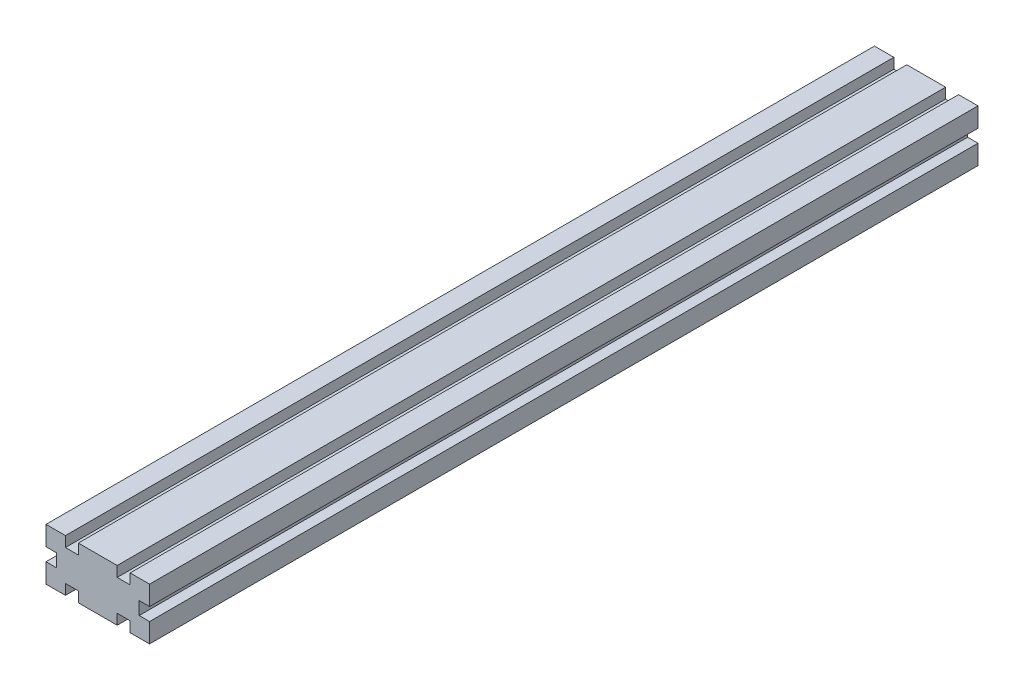
ISO-10303-21;
HEADER;
FILE_DESCRIPTION(('STEP AP214'),'2;1');
FILE_NAME('part.step','',(''),(''),'','','');
FILE_SCHEMA(('AUTOMOTIVE_DESIGN { 1 0 10303 214 1 1 1 1 }'));
ENDSEC;
DATA;
#1=APPLICATION_CONTEXT('core data for automotive mechanical design processes');
#2=APPLICATION_PROTOCOL_DEFINITION('international standard','automotive_design',2000,#1);
#3=PRODUCT_CONTEXT('',#1,'mechanical');
#4=PRODUCT('Part','Part','',(#3));
#5=PRODUCT_RELATED_PRODUCT_CATEGORY('part','',(#4));
#6=PRODUCT_DEFINITION_FORMATION('','',#4);
#7=PRODUCT_DEFINITION_CONTEXT('part definition',#1,'design');
#8=PRODUCT_DEFINITION('design','',#6,#7);
#9=PRODUCT_DEFINITION_SHAPE('','',#8);
#10=(LENGTH_UNIT() NAMED_UNIT(*) SI_UNIT(.MILLI.,.METRE.));
#11=(NAMED_UNIT(*) PLANE_ANGLE_UNIT() SI_UNIT($,.RADIAN.));
#12=(NAMED_UNIT(*) SI_UNIT($,.STERADIAN.) SOLID_ANGLE_UNIT());
#13=UNCERTAINTY_MEASURE_WITH_UNIT(LENGTH_MEASURE(1.E-05),#10,'distance_accuracy_value','');
#14=(GEOMETRIC_REPRESENTATION_CONTEXT(3) GLOBAL_UNCERTAINTY_ASSIGNED_CONTEXT((#13)) GLOBAL_UNIT_ASSIGNED_CONTEXT((#10,
#11,#12)) REPRESENTATION_CONTEXT('',''));
#15=CARTESIAN_POINT('',(0.,0.,0.));
#16=DIRECTION('',(0.,0.,1.));
#17=DIRECTION('',(1.,0.,0.));
#18=AXIS2_PLACEMENT_3D('',#15,#16,#17);
#19=CARTESIAN_POINT('',(40.,0.,320.));
#20=DIRECTION('',(-1.,0.,0.));
#21=DIRECTION('',(0.,0.,1.));
#22=AXIS2_PLACEMENT_3D('',#19,#20,#21);
#23=PLANE('',#22);
#24=DIRECTION('',(0.,1.,0.));
#25=VECTOR('',#24,1.);
#26=CARTESIAN_POINT('',(40.,0.,0.));
#27=LINE('',#26,#25);
#28=CARTESIAN_POINT('',(40.,12.5,0.));
#29=VERTEX_POINT('',#28);
#30=CARTESIAN_POINT('',(40.,20.,0.));
#31=VERTEX_POINT('',#30);
#32=EDGE_CURVE('E257',#29,#31,#27,.T.);
#33=ORIENTED_EDGE('',*,*,#32,.T.);
#34=DIRECTION('',(0.,0.,-1.));
#35=VECTOR('',#34,1.);
#36=CARTESIAN_POINT('',(40.,20.,320.));
#37=LINE('',#36,#35);
#38=CARTESIAN_POINT('',(40.,20.,320.));
#39=VERTEX_POINT('',#38);
#40=EDGE_CURVE('E11',#39,#31,#37,.T.);
#41=ORIENTED_EDGE('',*,*,#40,.F.);
#42=DIRECTION('',(0.,1.,0.));
#43=VECTOR('',#42,1.);
#44=CARTESIAN_POINT('',(40.,0.,320.));
#45=LINE('',#44,#43);
#46=CARTESIAN_POINT('',(40.,12.5,320.));
#47=VERTEX_POINT('',#46);
#48=EDGE_CURVE('E156',#47,#39,#45,.T.);
#49=ORIENTED_EDGE('',*,*,#48,.F.);
#50=DIRECTION('',(0.,0.,-1.));
#51=VECTOR('',#50,1.);
#52=CARTESIAN_POINT('',(40.,12.5,320.));
#53=LINE('',#52,#51);
#54=EDGE_CURVE('E256',#47,#29,#53,.T.);
#55=ORIENTED_EDGE('',*,*,#54,.T.);
#56=EDGE_LOOP('',(#33,#41,#49,#55));
#57=FACE_BOUND('',#56,.T.);
#58=ADVANCED_FACE('F41',(#57),#23,.F.);
#59=CARTESIAN_POINT('',(0.,20.,320.));
#60=DIRECTION('',(0.,1.,0.));
#61=DIRECTION('',(0.,0.,1.));
#62=AXIS2_PLACEMENT_3D('',#59,#60,#61);
#63=PLANE('',#62);
#64=DIRECTION('',(1.,0.,0.));
#65=VECTOR('',#64,1.);
#66=CARTESIAN_POINT('',(0.,20.,0.));
#67=LINE('',#66,#65);
#68=CARTESIAN_POINT('',(32.5,20.,0.));
#69=VERTEX_POINT('',#68);
#70=EDGE_CURVE('E260',#69,#31,#67,.T.);
#71=ORIENTED_EDGE('',*,*,#70,.F.);
#72=DIRECTION('',(0.,0.,-1.));
#73=VECTOR('',#72,1.);
#74=CARTESIAN_POINT('',(32.5,20.,320.));
#75=LINE('',#74,#73);
#76=CARTESIAN_POINT('',(32.5,20.,320.));
#77=VERTEX_POINT('',#76);
#78=EDGE_CURVE('E49',#77,#69,#75,.T.);
#79=ORIENTED_EDGE('',*,*,#78,.F.);
#80=DIRECTION('',(1.,0.,0.));
#81=VECTOR('',#80,1.);
#82=CARTESIAN_POINT('',(0.,20.,320.));
#83=LINE('',#82,#81);
#84=EDGE_CURVE('E402',#77,#39,#83,.T.);
#85=ORIENTED_EDGE('',*,*,#84,.T.);
#86=ORIENTED_EDGE('',*,*,#40,.T.);
#87=EDGE_LOOP('',(#71,#79,#85,#86));
#88=FACE_BOUND('',#87,.T.);
#89=ADVANCED_FACE('F390',(#88),#63,.T.);
#90=CARTESIAN_POINT('',(32.5,0.,320.));
#91=DIRECTION('',(-1.,0.,0.));
#92=DIRECTION('',(0.,0.,1.));
#93=AXIS2_PLACEMENT_3D('',#90,#91,#92);
#94=PLANE('',#93);
#95=DIRECTION('',(0.,1.,0.));
#96=VECTOR('',#95,1.);
#97=CARTESIAN_POINT('',(32.5,0.,0.));
#98=LINE('',#97,#96);
#99=CARTESIAN_POINT('',(32.5,16.,0.));
#100=VERTEX_POINT('',#99);
#101=EDGE_CURVE('E263',#100,#69,#98,.T.);
#102=ORIENTED_EDGE('',*,*,#101,.F.);
#103=DIRECTION('',(0.,0.,-1.));
#104=VECTOR('',#103,1.);
#105=CARTESIAN_POINT('',(32.5,16.,320.));
#106=LINE('',#105,#104);
#107=CARTESIAN_POINT('',(32.5,16.,320.));
#108=VERTEX_POINT('',#107);
#109=EDGE_CURVE('E380',#108,#100,#106,.T.);
#110=ORIENTED_EDGE('',*,*,#109,.F.);
#111=DIRECTION('',(0.,1.,0.));
#112=VECTOR('',#111,1.);
#113=CARTESIAN_POINT('',(32.5,0.,320.));
#114=LINE('',#113,#112);
#115=EDGE_CURVE('E387',#108,#77,#114,.T.);
#116=ORIENTED_EDGE('',*,*,#115,.T.);
#117=ORIENTED_EDGE('',*,*,#78,.T.);
#118=EDGE_LOOP('',(#102,#110,#116,#117));
#119=FACE_BOUND('',#118,.T.);
#120=ADVANCED_FACE('F385',(#119),#94,.T.);
#121=CARTESIAN_POINT('',(0.,16.,320.));
#122=DIRECTION('',(0.,1.,0.));
#123=DIRECTION('',(0.,0.,1.));
#124=AXIS2_PLACEMENT_3D('',#121,#122,#123);
#125=PLANE('',#124);
#126=DIRECTION('',(1.,0.,0.));
#127=VECTOR('',#126,1.);
#128=CARTESIAN_POINT('',(0.,16.,0.));
#129=LINE('',#128,#127);
#130=CARTESIAN_POINT('',(27.5,16.,0.));
#131=VERTEX_POINT('',#130);
#132=EDGE_CURVE('E266',#131,#100,#129,.T.);
#133=ORIENTED_EDGE('',*,*,#132,.F.);
#134=DIRECTION('',(0.,0.,-1.));
#135=VECTOR('',#134,1.);
#136=CARTESIAN_POINT('',(27.5,16.,320.));
#137=LINE('',#136,#135);
#138=CARTESIAN_POINT('',(27.5,16.,320.));
#139=VERTEX_POINT('',#138);
#140=EDGE_CURVE('E378',#139,#131,#137,.T.);
#141=ORIENTED_EDGE('',*,*,#140,.F.);
#142=DIRECTION('',(1.,0.,0.));
#143=VECTOR('',#142,1.);
#144=CARTESIAN_POINT('',(0.,16.,320.));
#145=LINE('',#144,#143);
#146=EDGE_CURVE('E401',#139,#108,#145,.T.);
#147=ORIENTED_EDGE('',*,*,#146,.T.);
#148=ORIENTED_EDGE('',*,*,#109,.T.);
#149=EDGE_LOOP('',(#133,#141,#147,#148));
#150=FACE_BOUND('',#149,.T.);
#151=ADVANCED_FACE('F397',(#150),#125,.T.);
#152=CARTESIAN_POINT('',(27.5,0.,320.));
#153=DIRECTION('',(-1.,0.,0.));
#154=DIRECTION('',(0.,0.,1.));
#155=AXIS2_PLACEMENT_3D('',#152,#153,#154);
#156=PLANE('',#155);
#157=DIRECTION('',(0.,1.,0.));
#158=VECTOR('',#157,1.);
#159=CARTESIAN_POINT('',(27.5,0.,0.));
#160=LINE('',#159,#158);
#161=CARTESIAN_POINT('',(27.5,20.,0.));
#162=VERTEX_POINT('',#161);
#163=EDGE_CURVE('E269',#131,#162,#160,.T.);
#164=ORIENTED_EDGE('',*,*,#163,.T.);
#165=DIRECTION('',(0.,0.,-1.));
#166=VECTOR('',#165,1.);
#167=CARTESIAN_POINT('',(27.5,20.,320.));
#168=LINE('',#167,#166);
#169=CARTESIAN_POINT('',(27.5,20.,320.));
#170=VERTEX_POINT('',#169);
#171=EDGE_CURVE('E376',#170,#162,#168,.T.);
#172=ORIENTED_EDGE('',*,*,#171,.F.);
#173=DIRECTION('',(0.,1.,0.));
#174=VECTOR('',#173,1.);
#175=CARTESIAN_POINT('',(27.5,0.,320.));
#176=LINE('',#175,#174);
#177=EDGE_CURVE('E404',#139,#170,#176,.T.);
#178=ORIENTED_EDGE('',*,*,#177,.F.);
#179=ORIENTED_EDGE('',*,*,#140,.T.);
#180=EDGE_LOOP('',(#164,#172,#178,#179));
#181=FACE_BOUND('',#180,.T.);
#182=ADVANCED_FACE('F486',(#181),#156,.F.);
#183=CARTESIAN_POINT('',(0.,20.,320.));
#184=DIRECTION('',(0.,1.,0.));
#185=DIRECTION('',(0.,0.,1.));
#186=AXIS2_PLACEMENT_3D('',#183,#184,#185);
#187=PLANE('',#186);
#188=DIRECTION('',(1.,0.,0.));
#189=VECTOR('',#188,1.);
#190=CARTESIAN_POINT('',(0.,20.,0.));
#191=LINE('',#190,#189);
#192=CARTESIAN_POINT('',(12.5,20.,0.));
#193=VERTEX_POINT('',#192);
#194=EDGE_CURVE('E272',#193,#162,#191,.T.);
#195=ORIENTED_EDGE('',*,*,#194,.F.);
#196=DIRECTION('',(0.,0.,-1.));
#197=VECTOR('',#196,1.);
#198=CARTESIAN_POINT('',(12.5,20.,320.));
#199=LINE('',#198,#197);
#200=CARTESIAN_POINT('',(12.5,20.,320.));
#201=VERTEX_POINT('',#200);
#202=EDGE_CURVE('E374',#201,#193,#199,.T.);
#203=ORIENTED_EDGE('',*,*,#202,.F.);
#204=DIRECTION('',(1.,0.,0.));
#205=VECTOR('',#204,1.);
#206=CARTESIAN_POINT('',(0.,20.,320.));
#207=LINE('',#206,#205);
#208=EDGE_CURVE('E410',#201,#170,#207,.T.);
#209=ORIENTED_EDGE('',*,*,#208,.T.);
#210=ORIENTED_EDGE('',*,*,#171,.T.);
#211=EDGE_LOOP('',(#195,#203,#209,#210));
#212=FACE_BOUND('',#211,.T.);
#213=ADVANCED_FACE('F489',(#212),#187,.T.);
#214=CARTESIAN_POINT('',(12.5,0.,320.));
#215=DIRECTION('',(-1.,0.,0.));
#216=DIRECTION('',(0.,0.,1.));
#217=AXIS2_PLACEMENT_3D('',#214,#215,#216);
#218=PLANE('',#217);
#219=DIRECTION('',(0.,1.,0.));
#220=VECTOR('',#219,1.);
#221=CARTESIAN_POINT('',(12.5,0.,0.));
#222=LINE('',#221,#220);
#223=CARTESIAN_POINT('',(12.5,16.,0.));
#224=VERTEX_POINT('',#223);
#225=EDGE_CURVE('E275',#224,#193,#222,.T.);
#226=ORIENTED_EDGE('',*,*,#225,.F.);
#227=DIRECTION('',(0.,0.,-1.));
#228=VECTOR('',#227,1.);
#229=CARTESIAN_POINT('',(12.5,16.,320.));
#230=LINE('',#229,#228);
#231=CARTESIAN_POINT('',(12.5,16.,320.));
#232=VERTEX_POINT('',#231);
#233=EDGE_CURVE('E372',#232,#224,#230,.T.);
#234=ORIENTED_EDGE('',*,*,#233,.F.);
#235=DIRECTION('',(0.,1.,0.));
#236=VECTOR('',#235,1.);
#237=CARTESIAN_POINT('',(12.5,0.,320.));
#238=LINE('',#237,#236);
#239=EDGE_CURVE('E413',#232,#201,#238,.T.);
#240=ORIENTED_EDGE('',*,*,#239,.T.);
#241=ORIENTED_EDGE('',*,*,#202,.T.);
#242=EDGE_LOOP('',(#226,#234,#240,#241));
#243=FACE_BOUND('',#242,.T.);
#244=ADVANCED_FACE('F493',(#243),#218,.T.);
#245=CARTESIAN_POINT('',(0.,16.,320.));
#246=DIRECTION('',(0.,1.,0.));
#247=DIRECTION('',(0.,0.,1.));
#248=AXIS2_PLACEMENT_3D('',#245,#246,#247);
#249=PLANE('',#248);
#250=DIRECTION('',(1.,0.,0.));
#251=VECTOR('',#250,1.);
#252=CARTESIAN_POINT('',(0.,16.,0.));
#253=LINE('',#252,#251);
#254=CARTESIAN_POINT('',(7.5,16.,0.));
#255=VERTEX_POINT('',#254);
#256=EDGE_CURVE('E278',#255,#224,#253,.T.);
#257=ORIENTED_EDGE('',*,*,#256,.F.);
#258=DIRECTION('',(0.,0.,-1.));
#259=VECTOR('',#258,1.);
#260=CARTESIAN_POINT('',(7.5,16.,320.));
#261=LINE('',#260,#259);
#262=CARTESIAN_POINT('',(7.5,16.,320.));
#263=VERTEX_POINT('',#262);
#264=EDGE_CURVE('E370',#263,#255,#261,.T.);
#265=ORIENTED_EDGE('',*,*,#264,.F.);
#266=DIRECTION('',(1.,0.,0.));
#267=VECTOR('',#266,1.);
#268=CARTESIAN_POINT('',(0.,16.,320.));
#269=LINE('',#268,#267);
#270=EDGE_CURVE('E416',#263,#232,#269,.T.);
#271=ORIENTED_EDGE('',*,*,#270,.T.);
#272=ORIENTED_EDGE('',*,*,#233,.T.);
#273=EDGE_LOOP('',(#257,#265,#271,#272));
#274=FACE_BOUND('',#273,.T.);
#275=ADVANCED_FACE('F497',(#274),#249,.T.);
#276=CARTESIAN_POINT('',(7.5,0.,320.));
#277=DIRECTION('',(-1.,0.,0.));
#278=DIRECTION('',(0.,0.,1.));
#279=AXIS2_PLACEMENT_3D('',#276,#277,#278);
#280=PLANE('',#279);
#281=DIRECTION('',(0.,1.,0.));
#282=VECTOR('',#281,1.);
#283=CARTESIAN_POINT('',(7.5,0.,0.));
#284=LINE('',#283,#282);
#285=CARTESIAN_POINT('',(7.5,20.,0.));
#286=VERTEX_POINT('',#285);
#287=EDGE_CURVE('E281',#255,#286,#284,.T.);
#288=ORIENTED_EDGE('',*,*,#287,.T.);
#289=DIRECTION('',(0.,0.,-1.));
#290=VECTOR('',#289,1.);
#291=CARTESIAN_POINT('',(7.5,20.,320.));
#292=LINE('',#291,#290);
#293=CARTESIAN_POINT('',(7.5,20.,320.));
#294=VERTEX_POINT('',#293);
#295=EDGE_CURVE('E368',#294,#286,#292,.T.);
#296=ORIENTED_EDGE('',*,*,#295,.F.);
#297=DIRECTION('',(0.,1.,0.));
#298=VECTOR('',#297,1.);
#299=CARTESIAN_POINT('',(7.5,0.,320.));
#300=LINE('',#299,#298);
#301=EDGE_CURVE('E419',#263,#294,#300,.T.);
#302=ORIENTED_EDGE('',*,*,#301,.F.);
#303=ORIENTED_EDGE('',*,*,#264,.T.);
#304=EDGE_LOOP('',(#288,#296,#302,#303));
#305=FACE_BOUND('',#304,.T.);
#306=ADVANCED_FACE('F501',(#305),#280,.F.);
#307=CARTESIAN_POINT('',(0.,20.,320.));
#308=DIRECTION('',(0.,1.,0.));
#309=DIRECTION('',(0.,0.,1.));
#310=AXIS2_PLACEMENT_3D('',#307,#308,#309);
#311=PLANE('',#310);
#312=DIRECTION('',(1.,0.,0.));
#313=VECTOR('',#312,1.);
#314=CARTESIAN_POINT('',(0.,20.,0.));
#315=LINE('',#314,#313);
#316=CARTESIAN_POINT('',(0.,20.,0.));
#317=VERTEX_POINT('',#316);
#318=EDGE_CURVE('E284',#317,#286,#315,.T.);
#319=ORIENTED_EDGE('',*,*,#318,.F.);
#320=DIRECTION('',(0.,0.,-1.));
#321=VECTOR('',#320,1.);
#322=CARTESIAN_POINT('',(0.,20.,320.));
#323=LINE('',#322,#321);
#324=CARTESIAN_POINT('',(0.,20.,320.));
#325=VERTEX_POINT('',#324);
#326=EDGE_CURVE('E366',#325,#317,#323,.T.);
#327=ORIENTED_EDGE('',*,*,#326,.F.);
#328=DIRECTION('',(1.,0.,0.));
#329=VECTOR('',#328,1.);
#330=CARTESIAN_POINT('',(0.,20.,320.));
#331=LINE('',#330,#329);
#332=EDGE_CURVE('E421',#325,#294,#331,.T.);
#333=ORIENTED_EDGE('',*,*,#332,.T.);
#334=ORIENTED_EDGE('',*,*,#295,.T.);
#335=EDGE_LOOP('',(#319,#327,#333,#334));
#336=FACE_BOUND('',#335,.T.);
#337=ADVANCED_FACE('F505',(#336),#311,.T.);
#338=CARTESIAN_POINT('',(0.,0.,320.));
#339=DIRECTION('',(-1.,0.,0.));
#340=DIRECTION('',(0.,0.,1.));
#341=AXIS2_PLACEMENT_3D('',#338,#339,#340);
#342=PLANE('',#341);
#343=DIRECTION('',(0.,1.,0.));
#344=VECTOR('',#343,1.);
#345=CARTESIAN_POINT('',(0.,0.,0.));
#346=LINE('',#345,#344);
#347=CARTESIAN_POINT('',(0.,12.5,0.));
#348=VERTEX_POINT('',#347);
#349=EDGE_CURVE('E287',#348,#317,#346,.T.);
#350=ORIENTED_EDGE('',*,*,#349,.F.);
#351=DIRECTION('',(0.,0.,-1.));
#352=VECTOR('',#351,1.);
#353=CARTESIAN_POINT('',(0.,12.5,320.));
#354=LINE('',#353,#352);
#355=CARTESIAN_POINT('',(0.,12.5,320.));
#356=VERTEX_POINT('',#355);
#357=EDGE_CURVE('E364',#356,#348,#354,.T.);
#358=ORIENTED_EDGE('',*,*,#357,.F.);
#359=DIRECTION('',(0.,1.,0.));
#360=VECTOR('',#359,1.);
#361=CARTESIAN_POINT('',(0.,0.,320.));
#362=LINE('',#361,#360);
#363=EDGE_CURVE('E424',#356,#325,#362,.T.);
#364=ORIENTED_EDGE('',*,*,#363,.T.);
#365=ORIENTED_EDGE('',*,*,#326,.T.);
#366=EDGE_LOOP('',(#350,#358,#364,#365));
#367=FACE_BOUND('',#366,.T.);
#368=ADVANCED_FACE('F509',(#367),#342,.T.);
#369=CARTESIAN_POINT('',(0.,12.5,320.));
#370=DIRECTION('',(0.,1.,0.));
#371=DIRECTION('',(-1.,0.,0.));
#372=AXIS2_PLACEMENT_3D('',#369,#370,#371);
#373=PLANE('',#372);
#374=DIRECTION('',(1.,0.,0.));
#375=VECTOR('',#374,1.);
#376=CARTESIAN_POINT('',(0.,12.5,0.));
#377=LINE('',#376,#375);
#378=CARTESIAN_POINT('',(4.,12.5,0.));
#379=VERTEX_POINT('',#378);
#380=EDGE_CURVE('E290',#348,#379,#377,.T.);
#381=ORIENTED_EDGE('',*,*,#380,.T.);
#382=DIRECTION('',(0.,0.,-1.));
#383=VECTOR('',#382,1.);
#384=CARTESIAN_POINT('',(4.,12.5,320.));
#385=LINE('',#384,#383);
#386=CARTESIAN_POINT('',(4.,12.5,320.));
#387=VERTEX_POINT('',#386);
#388=EDGE_CURVE('E362',#387,#379,#385,.T.);
#389=ORIENTED_EDGE('',*,*,#388,.F.);
#390=DIRECTION('',(1.,0.,0.));
#391=VECTOR('',#390,1.);
#392=CARTESIAN_POINT('',(0.,12.5,320.));
#393=LINE('',#392,#391);
#394=EDGE_CURVE('E427',#356,#387,#393,.T.);
#395=ORIENTED_EDGE('',*,*,#394,.F.);
#396=ORIENTED_EDGE('',*,*,#357,.T.);
#397=EDGE_LOOP('',(#381,#389,#395,#396));
#398=FACE_BOUND('',#397,.T.);
#399=ADVANCED_FACE('F513',(#398),#373,.F.);
#400=CARTESIAN_POINT('',(4.,0.,320.));
#401=DIRECTION('',(-1.,0.,0.));
#402=DIRECTION('',(0.,0.,1.));
#403=AXIS2_PLACEMENT_3D('',#400,#401,#402);
#404=PLANE('',#403);
#405=DIRECTION('',(0.,1.,0.));
#406=VECTOR('',#405,1.);
#407=CARTESIAN_POINT('',(4.,0.,0.));
#408=LINE('',#407,#406);
#409=CARTESIAN_POINT('',(4.,7.5,0.));
#410=VERTEX_POINT('',#409);
#411=EDGE_CURVE('E293',#410,#379,#408,.T.);
#412=ORIENTED_EDGE('',*,*,#411,.F.);
#413=DIRECTION('',(0.,0.,-1.));
#414=VECTOR('',#413,1.);
#415=CARTESIAN_POINT('',(4.,7.5,320.));
#416=LINE('',#415,#414);
#417=CARTESIAN_POINT('',(4.,7.5,320.));
#418=VERTEX_POINT('',#417);
#419=EDGE_CURVE('E360',#418,#410,#416,.T.);
#420=ORIENTED_EDGE('',*,*,#419,.F.);
#421=DIRECTION('',(0.,1.,0.));
#422=VECTOR('',#421,1.);
#423=CARTESIAN_POINT('',(4.,0.,320.));
#424=LINE('',#423,#422);
#425=EDGE_CURVE('E429',#418,#387,#424,.T.);
#426=ORIENTED_EDGE('',*,*,#425,.T.);
#427=ORIENTED_EDGE('',*,*,#388,.T.);
#428=EDGE_LOOP('',(#412,#420,#426,#427));
#429=FACE_BOUND('',#428,.T.);
#430=ADVANCED_FACE('F517',(#429),#404,.T.);
#431=CARTESIAN_POINT('',(0.,7.5,320.));
#432=DIRECTION('',(0.,1.,0.));
#433=DIRECTION('',(-1.,0.,0.));
#434=AXIS2_PLACEMENT_3D('',#431,#432,#433);
#435=PLANE('',#434);
#436=DIRECTION('',(1.,0.,0.));
#437=VECTOR('',#436,1.);
#438=CARTESIAN_POINT('',(0.,7.5,0.));
#439=LINE('',#438,#437);
#440=CARTESIAN_POINT('',(0.,7.5,0.));
#441=VERTEX_POINT('',#440);
#442=EDGE_CURVE('E296',#441,#410,#439,.T.);
#443=ORIENTED_EDGE('',*,*,#442,.F.);
#444=DIRECTION('',(0.,0.,-1.));
#445=VECTOR('',#444,1.);
#446=CARTESIAN_POINT('',(0.,7.5,320.));
#447=LINE('',#446,#445);
#448=CARTESIAN_POINT('',(0.,7.5,320.));
#449=VERTEX_POINT('',#448);
#450=EDGE_CURVE('E358',#449,#441,#447,.T.);
#451=ORIENTED_EDGE('',*,*,#450,.F.);
#452=DIRECTION('',(1.,0.,0.));
#453=VECTOR('',#452,1.);
#454=CARTESIAN_POINT('',(0.,7.5,320.));
#455=LINE('',#454,#453);
#456=EDGE_CURVE('E432',#449,#418,#455,.T.);
#457=ORIENTED_EDGE('',*,*,#456,.T.);
#458=ORIENTED_EDGE('',*,*,#419,.T.);
#459=EDGE_LOOP('',(#443,#451,#457,#458));
#460=FACE_BOUND('',#459,.T.);
#461=ADVANCED_FACE('F521',(#460),#435,.T.);
#462=CARTESIAN_POINT('',(0.,0.,320.));
#463=DIRECTION('',(-1.,0.,0.));
#464=DIRECTION('',(0.,0.,1.));
#465=AXIS2_PLACEMENT_3D('',#462,#463,#464);
#466=PLANE('',#465);
#467=DIRECTION('',(0.,1.,0.));
#468=VECTOR('',#467,1.);
#469=CARTESIAN_POINT('',(0.,0.,0.));
#470=LINE('',#469,#468);
#471=CARTESIAN_POINT('',(0.,0.,0.));
#472=VERTEX_POINT('',#471);
#473=EDGE_CURVE('E299',#472,#441,#470,.T.);
#474=ORIENTED_EDGE('',*,*,#473,.F.);
#475=DIRECTION('',(0.,0.,-1.));
#476=VECTOR('',#475,1.);
#477=CARTESIAN_POINT('',(0.,0.,320.));
#478=LINE('',#477,#476);
#479=CARTESIAN_POINT('',(0.,0.,320.));
#480=VERTEX_POINT('',#479);
#481=EDGE_CURVE('E356',#480,#472,#478,.T.);
#482=ORIENTED_EDGE('',*,*,#481,.F.);
#483=DIRECTION('',(0.,1.,0.));
#484=VECTOR('',#483,1.);
#485=CARTESIAN_POINT('',(0.,0.,320.));
#486=LINE('',#485,#484);
#487=EDGE_CURVE('E435',#480,#449,#486,.T.);
#488=ORIENTED_EDGE('',*,*,#487,.T.);
#489=ORIENTED_EDGE('',*,*,#450,.T.);
#490=EDGE_LOOP('',(#474,#482,#488,#489));
#491=FACE_BOUND('',#490,.T.);
#492=ADVANCED_FACE('F525',(#491),#466,.T.);
#493=CARTESIAN_POINT('',(0.,0.,320.));
#494=DIRECTION('',(0.,1.,0.));
#495=DIRECTION('',(0.,0.,1.));
#496=AXIS2_PLACEMENT_3D('',#493,#494,#495);
#497=PLANE('',#496);
#498=DIRECTION('',(1.,0.,0.));
#499=VECTOR('',#498,1.);
#500=CARTESIAN_POINT('',(0.,0.,0.));
#501=LINE('',#500,#499);
#502=CARTESIAN_POINT('',(7.5,0.,0.));
#503=VERTEX_POINT('',#502);
#504=EDGE_CURVE('E302',#472,#503,#501,.T.);
#505=ORIENTED_EDGE('',*,*,#504,.T.);
#506=DIRECTION('',(0.,0.,-1.));
#507=VECTOR('',#506,1.);
#508=CARTESIAN_POINT('',(7.5,0.,320.));
#509=LINE('',#508,#507);
#510=CARTESIAN_POINT('',(7.5,0.,320.));
#511=VERTEX_POINT('',#510);
#512=EDGE_CURVE('E353',#511,#503,#509,.T.);
#513=ORIENTED_EDGE('',*,*,#512,.F.);
#514=DIRECTION('',(1.,0.,0.));
#515=VECTOR('',#514,1.);
#516=CARTESIAN_POINT('',(0.,0.,320.));
#517=LINE('',#516,#515);
#518=EDGE_CURVE('E438',#480,#511,#517,.T.);
#519=ORIENTED_EDGE('',*,*,#518,.F.);
#520=ORIENTED_EDGE('',*,*,#481,.T.);
#521=EDGE_LOOP('',(#505,#513,#519,#520));
#522=FACE_BOUND('',#521,.T.);
#523=ADVANCED_FACE('F529',(#522),#497,.F.);
#524=CARTESIAN_POINT('',(7.5,0.,320.));
#525=DIRECTION('',(-1.,0.,0.));
#526=DIRECTION('',(0.,0.,1.));
#527=AXIS2_PLACEMENT_3D('',#524,#525,#526);
#528=PLANE('',#527);
#529=DIRECTION('',(0.,1.,0.));
#530=VECTOR('',#529,1.);
#531=CARTESIAN_POINT('',(7.5,0.,0.));
#532=LINE('',#531,#530);
#533=CARTESIAN_POINT('',(7.5,4.,0.));
#534=VERTEX_POINT('',#533);
#535=EDGE_CURVE('E304',#503,#534,#532,.T.);
#536=ORIENTED_EDGE('',*,*,#535,.T.);
#537=DIRECTION('',(0.,0.,-1.));
#538=VECTOR('',#537,1.);
#539=CARTESIAN_POINT('',(7.5,4.,320.));
#540=LINE('',#539,#538);
#541=CARTESIAN_POINT('',(7.5,4.,320.));
#542=VERTEX_POINT('',#541);
#543=EDGE_CURVE('E350',#542,#534,#540,.T.);
#544=ORIENTED_EDGE('',*,*,#543,.F.);
#545=DIRECTION('',(0.,1.,0.));
#546=VECTOR('',#545,1.);
#547=CARTESIAN_POINT('',(7.5,0.,320.));
#548=LINE('',#547,#546);
#549=EDGE_CURVE('E440',#511,#542,#548,.T.);
#550=ORIENTED_EDGE('',*,*,#549,.F.);
#551=ORIENTED_EDGE('',*,*,#512,.T.);
#552=EDGE_LOOP('',(#536,#544,#550,#551));
#553=FACE_BOUND('',#552,.T.);
#554=ADVANCED_FACE('F533',(#553),#528,.F.);
#555=CARTESIAN_POINT('',(0.,4.,320.));
#556=DIRECTION('',(0.,1.,0.));
#557=DIRECTION('',(0.,0.,1.));
#558=AXIS2_PLACEMENT_3D('',#555,#556,#557);
#559=PLANE('',#558);
#560=DIRECTION('',(1.,0.,0.));
#561=VECTOR('',#560,1.);
#562=CARTESIAN_POINT('',(0.,4.,0.));
#563=LINE('',#562,#561);
#564=CARTESIAN_POINT('',(12.5,4.,0.));
#565=VERTEX_POINT('',#564);
#566=EDGE_CURVE('E306',#534,#565,#563,.T.);
#567=ORIENTED_EDGE('',*,*,#566,.T.);
#568=DIRECTION('',(0.,0.,-1.));
#569=VECTOR('',#568,1.);
#570=CARTESIAN_POINT('',(12.5,4.,320.));
#571=LINE('',#570,#569);
#572=CARTESIAN_POINT('',(12.5,4.,320.));
#573=VERTEX_POINT('',#572);
#574=EDGE_CURVE('E348',#573,#565,#571,.T.);
#575=ORIENTED_EDGE('',*,*,#574,.F.);
#576=DIRECTION('',(1.,0.,0.));
#577=VECTOR('',#576,1.);
#578=CARTESIAN_POINT('',(0.,4.,320.));
#579=LINE('',#578,#577);
#580=EDGE_CURVE('E442',#542,#573,#579,.T.);
#581=ORIENTED_EDGE('',*,*,#580,.F.);
#582=ORIENTED_EDGE('',*,*,#543,.T.);
#583=EDGE_LOOP('',(#567,#575,#581,#582));
#584=FACE_BOUND('',#583,.T.);
#585=ADVANCED_FACE('F537',(#584),#559,.F.);
#586=CARTESIAN_POINT('',(12.5,0.,320.));
#587=DIRECTION('',(-1.,0.,0.));
#588=DIRECTION('',(0.,0.,1.));
#589=AXIS2_PLACEMENT_3D('',#586,#587,#588);
#590=PLANE('',#589);
#591=DIRECTION('',(0.,1.,0.));
#592=VECTOR('',#591,1.);
#593=CARTESIAN_POINT('',(12.5,0.,0.));
#594=LINE('',#593,#592);
#595=CARTESIAN_POINT('',(12.5,0.,0.));
#596=VERTEX_POINT('',#595);
#597=EDGE_CURVE('E309',#596,#565,#594,.T.);
#598=ORIENTED_EDGE('',*,*,#597,.F.);
#599=DIRECTION('',(0.,0.,-1.));
#600=VECTOR('',#599,1.);
#601=CARTESIAN_POINT('',(12.5,0.,320.));
#602=LINE('',#601,#600);
#603=CARTESIAN_POINT('',(12.5,0.,320.));
#604=VERTEX_POINT('',#603);
#605=EDGE_CURVE('E346',#604,#596,#602,.T.);
#606=ORIENTED_EDGE('',*,*,#605,.F.);
#607=DIRECTION('',(0.,1.,0.));
#608=VECTOR('',#607,1.);
#609=CARTESIAN_POINT('',(12.5,0.,320.));
#610=LINE('',#609,#608);
#611=EDGE_CURVE('E444',#604,#573,#610,.T.);
#612=ORIENTED_EDGE('',*,*,#611,.T.);
#613=ORIENTED_EDGE('',*,*,#574,.T.);
#614=EDGE_LOOP('',(#598,#606,#612,#613));
#615=FACE_BOUND('',#614,.T.);
#616=ADVANCED_FACE('F541',(#615),#590,.T.);
#617=CARTESIAN_POINT('',(0.,0.,320.));
#618=DIRECTION('',(0.,1.,0.));
#619=DIRECTION('',(0.,0.,1.));
#620=AXIS2_PLACEMENT_3D('',#617,#618,#619);
#621=PLANE('',#620);
#622=DIRECTION('',(1.,0.,0.));
#623=VECTOR('',#622,1.);
#624=CARTESIAN_POINT('',(0.,0.,0.));
#625=LINE('',#624,#623);
#626=CARTESIAN_POINT('',(27.5,0.,0.));
#627=VERTEX_POINT('',#626);
#628=EDGE_CURVE('E312',#596,#627,#625,.T.);
#629=ORIENTED_EDGE('',*,*,#628,.T.);
#630=DIRECTION('',(0.,0.,-1.));
#631=VECTOR('',#630,1.);
#632=CARTESIAN_POINT('',(27.5,0.,320.));
#633=LINE('',#632,#631);
#634=CARTESIAN_POINT('',(27.5,0.,320.));
#635=VERTEX_POINT('',#634);
#636=EDGE_CURVE('E343',#635,#627,#633,.T.);
#637=ORIENTED_EDGE('',*,*,#636,.F.);
#638=DIRECTION('',(1.,0.,0.));
#639=VECTOR('',#638,1.);
#640=CARTESIAN_POINT('',(0.,0.,320.));
#641=LINE('',#640,#639);
#642=EDGE_CURVE('E447',#604,#635,#641,.T.);
#643=ORIENTED_EDGE('',*,*,#642,.F.);
#644=ORIENTED_EDGE('',*,*,#605,.T.);
#645=EDGE_LOOP('',(#629,#637,#643,#644));
#646=FACE_BOUND('',#645,.T.);
#647=ADVANCED_FACE('F545',(#646),#621,.F.);
#648=CARTESIAN_POINT('',(27.5,0.,320.));
#649=DIRECTION('',(-1.,0.,0.));
#650=DIRECTION('',(0.,0.,1.));
#651=AXIS2_PLACEMENT_3D('',#648,#649,#650);
#652=PLANE('',#651);
#653=DIRECTION('',(0.,1.,0.));
#654=VECTOR('',#653,1.);
#655=CARTESIAN_POINT('',(27.5,0.,0.));
#656=LINE('',#655,#654);
#657=CARTESIAN_POINT('',(27.5,3.99999999999999,0.));
#658=VERTEX_POINT('',#657);
#659=EDGE_CURVE('E314',#627,#658,#656,.T.);
#660=ORIENTED_EDGE('',*,*,#659,.T.);
#661=DIRECTION('',(0.,0.,-1.));
#662=VECTOR('',#661,1.);
#663=CARTESIAN_POINT('',(27.5,3.99999999999999,320.));
#664=LINE('',#663,#662);
#665=CARTESIAN_POINT('',(27.5,3.99999999999999,320.));
#666=VERTEX_POINT('',#665);
#667=EDGE_CURVE('E340',#666,#658,#664,.T.);
#668=ORIENTED_EDGE('',*,*,#667,.F.);
#669=DIRECTION('',(0.,1.,0.));
#670=VECTOR('',#669,1.);
#671=CARTESIAN_POINT('',(27.5,0.,320.));
#672=LINE('',#671,#670);
#673=EDGE_CURVE('E449',#635,#666,#672,.T.);
#674=ORIENTED_EDGE('',*,*,#673,.F.);
#675=ORIENTED_EDGE('',*,*,#636,.T.);
#676=EDGE_LOOP('',(#660,#668,#674,#675));
#677=FACE_BOUND('',#676,.T.);
#678=ADVANCED_FACE('F549',(#677),#652,.F.);
#679=CARTESIAN_POINT('',(0.,3.99999999999999,320.));
#680=DIRECTION('',(0.,1.,0.));
#681=DIRECTION('',(0.,0.,1.));
#682=AXIS2_PLACEMENT_3D('',#679,#680,#681);
#683=PLANE('',#682);
#684=DIRECTION('',(1.,0.,0.));
#685=VECTOR('',#684,1.);
#686=CARTESIAN_POINT('',(0.,3.99999999999999,0.));
#687=LINE('',#686,#685);
#688=CARTESIAN_POINT('',(32.5,3.99999999999999,0.));
#689=VERTEX_POINT('',#688);
#690=EDGE_CURVE('E316',#658,#689,#687,.T.);
#691=ORIENTED_EDGE('',*,*,#690,.T.);
#692=DIRECTION('',(0.,0.,-1.));
#693=VECTOR('',#692,1.);
#694=CARTESIAN_POINT('',(32.5,3.99999999999999,320.));
#695=LINE('',#694,#693);
#696=CARTESIAN_POINT('',(32.5,3.99999999999999,320.));
#697=VERTEX_POINT('',#696);
#698=EDGE_CURVE('E338',#697,#689,#695,.T.);
#699=ORIENTED_EDGE('',*,*,#698,.F.);
#700=DIRECTION('',(1.,0.,0.));
#701=VECTOR('',#700,1.);
#702=CARTESIAN_POINT('',(0.,3.99999999999999,320.));
#703=LINE('',#702,#701);
#704=EDGE_CURVE('E451',#666,#697,#703,.T.);
#705=ORIENTED_EDGE('',*,*,#704,.F.);
#706=ORIENTED_EDGE('',*,*,#667,.T.);
#707=EDGE_LOOP('',(#691,#699,#705,#706));
#708=FACE_BOUND('',#707,.T.);
#709=ADVANCED_FACE('F553',(#708),#683,.F.);
#710=CARTESIAN_POINT('',(32.5,0.,320.));
#711=DIRECTION('',(-1.,0.,0.));
#712=DIRECTION('',(0.,0.,1.));
#713=AXIS2_PLACEMENT_3D('',#710,#711,#712);
#714=PLANE('',#713);
#715=DIRECTION('',(0.,1.,0.));
#716=VECTOR('',#715,1.);
#717=CARTESIAN_POINT('',(32.5,0.,0.));
#718=LINE('',#717,#716);
#719=CARTESIAN_POINT('',(32.5,0.,0.));
#720=VERTEX_POINT('',#719);
#721=EDGE_CURVE('E319',#720,#689,#718,.T.);
#722=ORIENTED_EDGE('',*,*,#721,.F.);
#723=DIRECTION('',(0.,0.,-1.));
#724=VECTOR('',#723,1.);
#725=CARTESIAN_POINT('',(32.5,0.,320.));
#726=LINE('',#725,#724);
#727=CARTESIAN_POINT('',(32.5,0.,320.));
#728=VERTEX_POINT('',#727);
#729=EDGE_CURVE('E336',#728,#720,#726,.T.);
#730=ORIENTED_EDGE('',*,*,#729,.F.);
#731=DIRECTION('',(0.,1.,0.));
#732=VECTOR('',#731,1.);
#733=CARTESIAN_POINT('',(32.5,0.,320.));
#734=LINE('',#733,#732);
#735=EDGE_CURVE('E453',#728,#697,#734,.T.);
#736=ORIENTED_EDGE('',*,*,#735,.T.);
#737=ORIENTED_EDGE('',*,*,#698,.T.);
#738=EDGE_LOOP('',(#722,#730,#736,#737));
#739=FACE_BOUND('',#738,.T.);
#740=ADVANCED_FACE('F557',(#739),#714,.T.);
#741=CARTESIAN_POINT('',(0.,0.,320.));
#742=DIRECTION('',(0.,1.,0.));
#743=DIRECTION('',(0.,0.,1.));
#744=AXIS2_PLACEMENT_3D('',#741,#742,#743);
#745=PLANE('',#744);
#746=DIRECTION('',(1.,0.,0.));
#747=VECTOR('',#746,1.);
#748=CARTESIAN_POINT('',(0.,0.,0.));
#749=LINE('',#748,#747);
#750=CARTESIAN_POINT('',(40.,0.,0.));
#751=VERTEX_POINT('',#750);
#752=EDGE_CURVE('E322',#720,#751,#749,.T.);
#753=ORIENTED_EDGE('',*,*,#752,.T.);
#754=DIRECTION('',(0.,0.,-1.));
#755=VECTOR('',#754,1.);
#756=CARTESIAN_POINT('',(40.,0.,320.));
#757=LINE('',#756,#755);
#758=CARTESIAN_POINT('',(40.,0.,320.));
#759=VERTEX_POINT('',#758);
#760=EDGE_CURVE('E333',#759,#751,#757,.T.);
#761=ORIENTED_EDGE('',*,*,#760,.F.);
#762=DIRECTION('',(1.,0.,0.));
#763=VECTOR('',#762,1.);
#764=CARTESIAN_POINT('',(0.,0.,320.));
#765=LINE('',#764,#763);
#766=EDGE_CURVE('E251',#728,#759,#765,.T.);
#767=ORIENTED_EDGE('',*,*,#766,.F.);
#768=ORIENTED_EDGE('',*,*,#729,.T.);
#769=EDGE_LOOP('',(#753,#761,#767,#768));
#770=FACE_BOUND('',#769,.T.);
#771=ADVANCED_FACE('F459',(#770),#745,.F.);
#772=CARTESIAN_POINT('',(40.,0.,320.));
#773=DIRECTION('',(-1.,0.,0.));
#774=DIRECTION('',(0.,0.,1.));
#775=AXIS2_PLACEMENT_3D('',#772,#773,#774);
#776=PLANE('',#775);
#777=DIRECTION('',(0.,1.,0.));
#778=VECTOR('',#777,1.);
#779=CARTESIAN_POINT('',(40.,0.,0.));
#780=LINE('',#779,#778);
#781=CARTESIAN_POINT('',(40.,7.5,0.));
#782=VERTEX_POINT('',#781);
#783=EDGE_CURVE('E324',#751,#782,#780,.T.);
#784=ORIENTED_EDGE('',*,*,#783,.T.);
#785=DIRECTION('',(0.,0.,-1.));
#786=VECTOR('',#785,1.);
#787=CARTESIAN_POINT('',(40.,7.5,320.));
#788=LINE('',#787,#786);
#789=CARTESIAN_POINT('',(40.,7.5,320.));
#790=VERTEX_POINT('',#789);
#791=EDGE_CURVE('E240',#790,#782,#788,.T.);
#792=ORIENTED_EDGE('',*,*,#791,.F.);
#793=DIRECTION('',(0.,1.,0.));
#794=VECTOR('',#793,1.);
#795=CARTESIAN_POINT('',(40.,0.,320.));
#796=LINE('',#795,#794);
#797=EDGE_CURVE('E248',#759,#790,#796,.T.);
#798=ORIENTED_EDGE('',*,*,#797,.F.);
#799=ORIENTED_EDGE('',*,*,#760,.T.);
#800=EDGE_LOOP('',(#784,#792,#798,#799));
#801=FACE_BOUND('',#800,.T.);
#802=ADVANCED_FACE('F463',(#801),#776,.F.);
#803=CARTESIAN_POINT('',(0.,7.5,320.));
#804=DIRECTION('',(0.,1.,0.));
#805=DIRECTION('',(-1.,0.,0.));
#806=AXIS2_PLACEMENT_3D('',#803,#804,#805);
#807=PLANE('',#806);
#808=DIRECTION('',(1.,0.,0.));
#809=VECTOR('',#808,1.);
#810=CARTESIAN_POINT('',(0.,7.5,0.));
#811=LINE('',#810,#809);
#812=CARTESIAN_POINT('',(36.,7.5,0.));
#813=VERTEX_POINT('',#812);
#814=EDGE_CURVE('E239',#813,#782,#811,.T.);
#815=ORIENTED_EDGE('',*,*,#814,.F.);
#816=DIRECTION('',(0.,0.,-1.));
#817=VECTOR('',#816,1.);
#818=CARTESIAN_POINT('',(36.,7.5,320.));
#819=LINE('',#818,#817);
#820=CARTESIAN_POINT('',(36.,7.5,320.));
#821=VERTEX_POINT('',#820);
#822=EDGE_CURVE('E233',#821,#813,#819,.T.);
#823=ORIENTED_EDGE('',*,*,#822,.F.);
#824=DIRECTION('',(1.,0.,0.));
#825=VECTOR('',#824,1.);
#826=CARTESIAN_POINT('',(0.,7.5,320.));
#827=LINE('',#826,#825);
#828=EDGE_CURVE('E237',#821,#790,#827,.T.);
#829=ORIENTED_EDGE('',*,*,#828,.T.);
#830=ORIENTED_EDGE('',*,*,#791,.T.);
#831=EDGE_LOOP('',(#815,#823,#829,#830));
#832=FACE_BOUND('',#831,.T.);
#833=ADVANCED_FACE('F235',(#832),#807,.T.);
#834=CARTESIAN_POINT('',(36.,0.,320.));
#835=DIRECTION('',(-1.,0.,0.));
#836=DIRECTION('',(0.,0.,1.));
#837=AXIS2_PLACEMENT_3D('',#834,#835,#836);
#838=PLANE('',#837);
#839=DIRECTION('',(0.,1.,0.));
#840=VECTOR('',#839,1.);
#841=CARTESIAN_POINT('',(36.,0.,0.));
#842=LINE('',#841,#840);
#843=CARTESIAN_POINT('',(36.,12.5,0.));
#844=VERTEX_POINT('',#843);
#845=EDGE_CURVE('E144',#813,#844,#842,.T.);
#846=ORIENTED_EDGE('',*,*,#845,.T.);
#847=DIRECTION('',(0.,0.,-1.));
#848=VECTOR('',#847,1.);
#849=CARTESIAN_POINT('',(36.,12.5,320.));
#850=LINE('',#849,#848);
#851=CARTESIAN_POINT('',(36.,12.5,320.));
#852=VERTEX_POINT('',#851);
#853=EDGE_CURVE('E241',#852,#844,#850,.T.);
#854=ORIENTED_EDGE('',*,*,#853,.F.);
#855=DIRECTION('',(0.,1.,0.));
#856=VECTOR('',#855,1.);
#857=CARTESIAN_POINT('',(36.,0.,320.));
#858=LINE('',#857,#856);
#859=EDGE_CURVE('E243',#821,#852,#858,.T.);
#860=ORIENTED_EDGE('',*,*,#859,.F.);
#861=ORIENTED_EDGE('',*,*,#822,.T.);
#862=EDGE_LOOP('',(#846,#854,#860,#861));
#863=FACE_BOUND('',#862,.T.);
#864=ADVANCED_FACE('F244',(#863),#838,.F.);
#865=CARTESIAN_POINT('',(0.,12.5,320.));
#866=DIRECTION('',(0.,1.,0.));
#867=DIRECTION('',(-1.,0.,0.));
#868=AXIS2_PLACEMENT_3D('',#865,#866,#867);
#869=PLANE('',#868);
#870=DIRECTION('',(1.,0.,0.));
#871=VECTOR('',#870,1.);
#872=CARTESIAN_POINT('',(0.,12.5,0.));
#873=LINE('',#872,#871);
#874=EDGE_CURVE('E150',#844,#29,#873,.T.);
#875=ORIENTED_EDGE('',*,*,#874,.T.);
#876=ORIENTED_EDGE('',*,*,#54,.F.);
#877=DIRECTION('',(1.,0.,0.));
#878=VECTOR('',#877,1.);
#879=CARTESIAN_POINT('',(0.,12.5,320.));
#880=LINE('',#879,#878);
#881=EDGE_CURVE('E57',#852,#47,#880,.T.);
#882=ORIENTED_EDGE('',*,*,#881,.F.);
#883=ORIENTED_EDGE('',*,*,#853,.T.);
#884=EDGE_LOOP('',(#875,#876,#882,#883));
#885=FACE_BOUND('',#884,.T.);
#886=ADVANCED_FACE('F465',(#885),#869,.F.);
#887=CARTESIAN_POINT('',(0.,0.,320.));
#888=DIRECTION('',(0.,0.,1.));
#889=DIRECTION('',(1.,0.,0.));
#890=AXIS2_PLACEMENT_3D('',#887,#888,#889);
#891=PLANE('',#890);
#892=ORIENTED_EDGE('',*,*,#48,.T.);
#893=ORIENTED_EDGE('',*,*,#84,.F.);
#894=ORIENTED_EDGE('',*,*,#115,.F.);
#895=ORIENTED_EDGE('',*,*,#146,.F.);
#896=ORIENTED_EDGE('',*,*,#177,.T.);
#897=ORIENTED_EDGE('',*,*,#208,.F.);
#898=ORIENTED_EDGE('',*,*,#239,.F.);
#899=ORIENTED_EDGE('',*,*,#270,.F.);
#900=ORIENTED_EDGE('',*,*,#301,.T.);
#901=ORIENTED_EDGE('',*,*,#332,.F.);
#902=ORIENTED_EDGE('',*,*,#363,.F.);
#903=ORIENTED_EDGE('',*,*,#394,.T.);
#904=ORIENTED_EDGE('',*,*,#425,.F.);
#905=ORIENTED_EDGE('',*,*,#456,.F.);
#906=ORIENTED_EDGE('',*,*,#487,.F.);
#907=ORIENTED_EDGE('',*,*,#518,.T.);
#908=ORIENTED_EDGE('',*,*,#549,.T.);
#909=ORIENTED_EDGE('',*,*,#580,.T.);
#910=ORIENTED_EDGE('',*,*,#611,.F.);
#911=ORIENTED_EDGE('',*,*,#642,.T.);
#912=ORIENTED_EDGE('',*,*,#673,.T.);
#913=ORIENTED_EDGE('',*,*,#704,.T.);
#914=ORIENTED_EDGE('',*,*,#735,.F.);
#915=ORIENTED_EDGE('',*,*,#766,.T.);
#916=ORIENTED_EDGE('',*,*,#797,.T.);
#917=ORIENTED_EDGE('',*,*,#828,.F.);
#918=ORIENTED_EDGE('',*,*,#859,.T.);
#919=ORIENTED_EDGE('',*,*,#881,.T.);
#920=EDGE_LOOP('',(#892,#893,#894,#895,#896,#897,#898,#899,#900,#901,#902,#903,#904,#905,#906,
#907,#908,#909,#910,#911,#912,#913,#914,#915,#916,#917,#918,#919));
#921=FACE_BOUND('',#920,.T.);
#922=ADVANCED_FACE('F246',(#921),#891,.T.);
#923=CARTESIAN_POINT('',(0.,0.,0.));
#924=DIRECTION('',(0.,0.,1.));
#925=DIRECTION('',(1.,0.,0.));
#926=AXIS2_PLACEMENT_3D('',#923,#924,#925);
#927=PLANE('',#926);
#928=ORIENTED_EDGE('',*,*,#32,.F.);
#929=ORIENTED_EDGE('',*,*,#874,.F.);
#930=ORIENTED_EDGE('',*,*,#845,.F.);
#931=ORIENTED_EDGE('',*,*,#814,.T.);
#932=ORIENTED_EDGE('',*,*,#783,.F.);
#933=ORIENTED_EDGE('',*,*,#752,.F.);
#934=ORIENTED_EDGE('',*,*,#721,.T.);
#935=ORIENTED_EDGE('',*,*,#690,.F.);
#936=ORIENTED_EDGE('',*,*,#659,.F.);
#937=ORIENTED_EDGE('',*,*,#628,.F.);
#938=ORIENTED_EDGE('',*,*,#597,.T.);
#939=ORIENTED_EDGE('',*,*,#566,.F.);
#940=ORIENTED_EDGE('',*,*,#535,.F.);
#941=ORIENTED_EDGE('',*,*,#504,.F.);
#942=ORIENTED_EDGE('',*,*,#473,.T.);
#943=ORIENTED_EDGE('',*,*,#442,.T.);
#944=ORIENTED_EDGE('',*,*,#411,.T.);
#945=ORIENTED_EDGE('',*,*,#380,.F.);
#946=ORIENTED_EDGE('',*,*,#349,.T.);
#947=ORIENTED_EDGE('',*,*,#318,.T.);
#948=ORIENTED_EDGE('',*,*,#287,.F.);
#949=ORIENTED_EDGE('',*,*,#256,.T.);
#950=ORIENTED_EDGE('',*,*,#225,.T.);
#951=ORIENTED_EDGE('',*,*,#194,.T.);
#952=ORIENTED_EDGE('',*,*,#163,.F.);
#953=ORIENTED_EDGE('',*,*,#132,.T.);
#954=ORIENTED_EDGE('',*,*,#101,.T.);
#955=ORIENTED_EDGE('',*,*,#70,.T.);
#956=EDGE_LOOP('',(#928,#929,#930,#931,#932,#933,#934,#935,#936,#937,#938,#939,#940,#941,#942,
#943,#944,#945,#946,#947,#948,#949,#950,#951,#952,#953,#954,#955));
#957=FACE_BOUND('',#956,.T.);
#958=ADVANCED_FACE('F393',(#957),#927,.F.);
#959=CLOSED_SHELL('',(#58,#89,#120,#151,#182,#213,#244,#275,#306,#337,#368,#399,#430,#461,#492,
#523,#554,#585,#616,#647,#678,#709,#740,#771,#802,#833,#864,#886,#922,#958));
#960=MANIFOLD_SOLID_BREP('B2',#959);
#961=ADVANCED_BREP_SHAPE_REPRESENTATION('',(#18,#960),#14);
#962=SHAPE_DEFINITION_REPRESENTATION(#9,#961);
ENDSEC;
END-ISO-10303-21;
